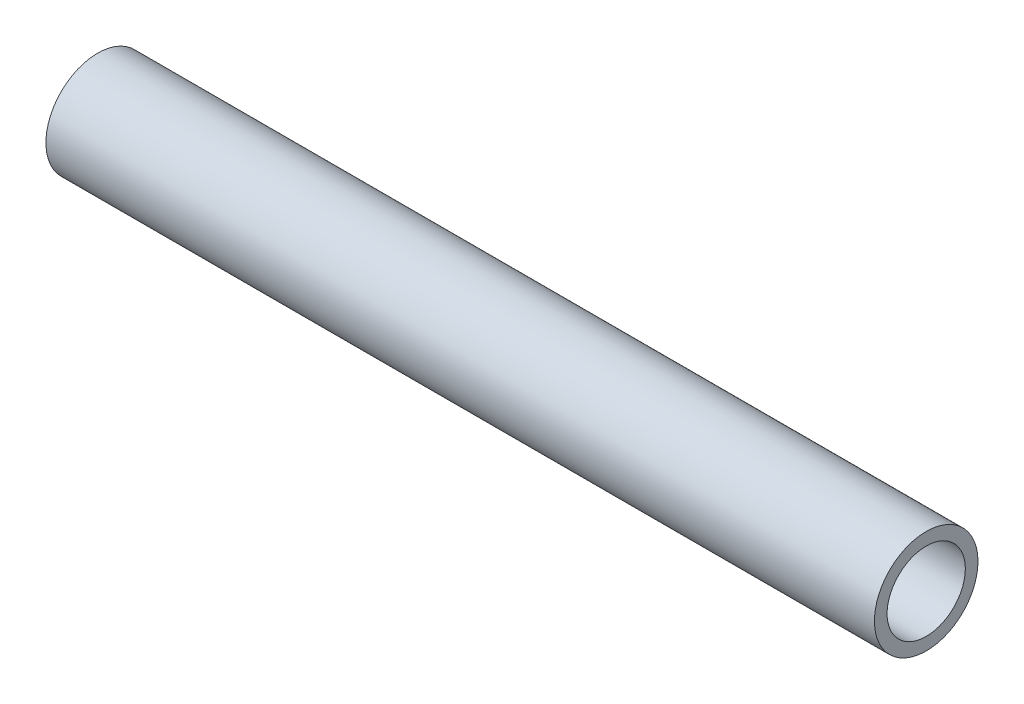
ISO-10303-21;
HEADER;
FILE_DESCRIPTION(('STEP AP214'),'2;1');
FILE_NAME('part.step','',(''),(''),'','','');
FILE_SCHEMA(('AUTOMOTIVE_DESIGN { 1 0 10303 214 1 1 1 1 }'));
ENDSEC;
DATA;
#1=APPLICATION_CONTEXT('core data for automotive mechanical design processes');
#2=APPLICATION_PROTOCOL_DEFINITION('international standard','automotive_design',2000,#1);
#3=PRODUCT_CONTEXT('',#1,'mechanical');
#4=PRODUCT('Part','Part','',(#3));
#5=PRODUCT_RELATED_PRODUCT_CATEGORY('part','',(#4));
#6=PRODUCT_DEFINITION_FORMATION('','',#4);
#7=PRODUCT_DEFINITION_CONTEXT('part definition',#1,'design');
#8=PRODUCT_DEFINITION('design','',#6,#7);
#9=PRODUCT_DEFINITION_SHAPE('','',#8);
#10=(LENGTH_UNIT() NAMED_UNIT(*) SI_UNIT(.MILLI.,.METRE.));
#11=(NAMED_UNIT(*) PLANE_ANGLE_UNIT() SI_UNIT($,.RADIAN.));
#12=(NAMED_UNIT(*) SI_UNIT($,.STERADIAN.) SOLID_ANGLE_UNIT());
#13=UNCERTAINTY_MEASURE_WITH_UNIT(LENGTH_MEASURE(1.E-05),#10,'distance_accuracy_value','');
#14=(GEOMETRIC_REPRESENTATION_CONTEXT(3) GLOBAL_UNCERTAINTY_ASSIGNED_CONTEXT((#13)) GLOBAL_UNIT_ASSIGNED_CONTEXT((#10,
#11,#12)) REPRESENTATION_CONTEXT('',''));
#15=CARTESIAN_POINT('',(0.,0.,0.));
#16=DIRECTION('',(0.,0.,1.));
#17=DIRECTION('',(1.,0.,0.));
#18=AXIS2_PLACEMENT_3D('',#15,#16,#17);
#19=CARTESIAN_POINT('',(228.6,0.,0.));
#20=DIRECTION('',(1.,0.,0.));
#21=DIRECTION('',(0.,0.,-1.));
#22=AXIS2_PLACEMENT_3D('',#19,#20,#21);
#23=PLANE('',#22);
#24=CARTESIAN_POINT('',(228.6,0.,0.));
#25=DIRECTION('',(1.,0.,0.));
#26=DIRECTION('',(0.,0.,-1.));
#27=AXIS2_PLACEMENT_3D('',#24,#25,#26);
#28=CIRCLE('',#27,28.575);
#29=CARTESIAN_POINT('',(228.6,0.,-28.575));
#30=VERTEX_POINT('',#29);
#31=EDGE_CURVE('E10',#30,#30,#28,.T.);
#32=ORIENTED_EDGE('',*,*,#31,.T.);
#33=EDGE_LOOP('',(#32));
#34=FACE_BOUND('',#33,.T.);
#35=CARTESIAN_POINT('',(228.6,0.,0.));
#36=DIRECTION('',(1.,0.,0.));
#37=DIRECTION('',(0.,0.,-1.));
#38=AXIS2_PLACEMENT_3D('',#35,#36,#37);
#39=CIRCLE('',#38,21.59);
#40=CARTESIAN_POINT('',(228.6,0.,-21.59));
#41=VERTEX_POINT('',#40);
#42=EDGE_CURVE('E42',#41,#41,#39,.T.);
#43=ORIENTED_EDGE('',*,*,#42,.F.);
#44=EDGE_LOOP('',(#43));
#45=FACE_BOUND('',#44,.T.);
#46=ADVANCED_FACE('F31',(#34,#45),#23,.T.);
#47=CARTESIAN_POINT('',(-228.6,0.,0.));
#48=DIRECTION('',(1.,0.,0.));
#49=DIRECTION('',(0.,0.,-1.));
#50=AXIS2_PLACEMENT_3D('',#47,#48,#49);
#51=PLANE('',#50);
#52=CARTESIAN_POINT('',(-228.6,0.,0.));
#53=DIRECTION('',(1.,0.,0.));
#54=DIRECTION('',(0.,0.,-1.));
#55=AXIS2_PLACEMENT_3D('',#52,#53,#54);
#56=CIRCLE('',#55,28.575);
#57=CARTESIAN_POINT('',(-228.6,0.,-28.575));
#58=VERTEX_POINT('',#57);
#59=EDGE_CURVE('E35',#58,#58,#56,.T.);
#60=ORIENTED_EDGE('',*,*,#59,.F.);
#61=EDGE_LOOP('',(#60));
#62=FACE_BOUND('',#61,.T.);
#63=CARTESIAN_POINT('',(-228.6,0.,0.));
#64=DIRECTION('',(1.,0.,0.));
#65=DIRECTION('',(0.,0.,-1.));
#66=AXIS2_PLACEMENT_3D('',#63,#64,#65);
#67=CIRCLE('',#66,21.59);
#68=CARTESIAN_POINT('',(-228.6,0.,-21.59));
#69=VERTEX_POINT('',#68);
#70=EDGE_CURVE('E44',#69,#69,#67,.T.);
#71=ORIENTED_EDGE('',*,*,#70,.T.);
#72=EDGE_LOOP('',(#71));
#73=FACE_BOUND('',#72,.T.);
#74=ADVANCED_FACE('F54',(#62,#73),#51,.F.);
#75=CARTESIAN_POINT('',(228.6,0.,0.));
#76=DIRECTION('',(-1.,0.,0.));
#77=DIRECTION('',(0.,0.,1.));
#78=AXIS2_PLACEMENT_3D('',#75,#76,#77);
#79=CYLINDRICAL_SURFACE('',#78,28.575);
#80=ORIENTED_EDGE('',*,*,#31,.F.);
#81=EDGE_LOOP('',(#80));
#82=FACE_BOUND('',#81,.T.);
#83=ORIENTED_EDGE('',*,*,#59,.T.);
#84=EDGE_LOOP('',(#83));
#85=FACE_BOUND('',#84,.T.);
#86=ADVANCED_FACE('F33',(#82,#85),#79,.T.);
#87=CARTESIAN_POINT('',(228.6,0.,0.));
#88=DIRECTION('',(-1.,0.,0.));
#89=DIRECTION('',(0.,0.,1.));
#90=AXIS2_PLACEMENT_3D('',#87,#88,#89);
#91=CYLINDRICAL_SURFACE('',#90,21.59);
#92=ORIENTED_EDGE('',*,*,#42,.T.);
#93=EDGE_LOOP('',(#92));
#94=FACE_BOUND('',#93,.T.);
#95=ORIENTED_EDGE('',*,*,#70,.F.);
#96=EDGE_LOOP('',(#95));
#97=FACE_BOUND('',#96,.T.);
#98=ADVANCED_FACE('F50',(#94,#97),#91,.F.);
#99=CLOSED_SHELL('',(#46,#74,#86,#98));
#100=MANIFOLD_SOLID_BREP('B2',#99);
#101=ADVANCED_BREP_SHAPE_REPRESENTATION('',(#18,#100),#14);
#102=SHAPE_DEFINITION_REPRESENTATION(#9,#101);
ENDSEC;
END-ISO-10303-21;
